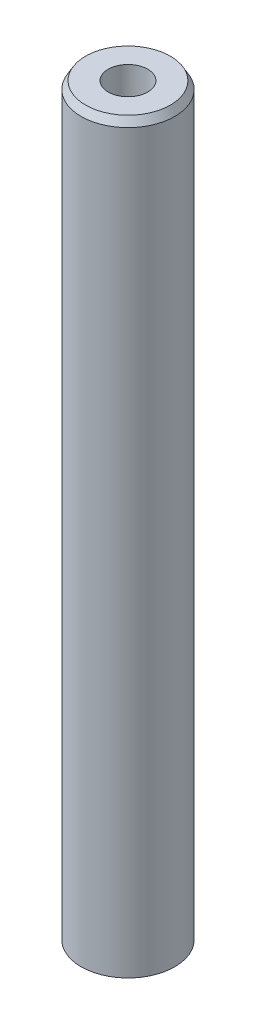
ISO-10303-21;
HEADER;
FILE_DESCRIPTION(('STEP AP214'),'2;1');
FILE_NAME('part.step','',(''),(''),'','','');
FILE_SCHEMA(('AUTOMOTIVE_DESIGN { 1 0 10303 214 1 1 1 1 }'));
ENDSEC;
DATA;
#1=APPLICATION_CONTEXT('core data for automotive mechanical design processes');
#2=APPLICATION_PROTOCOL_DEFINITION('international standard','automotive_design',2000,#1);
#3=PRODUCT_CONTEXT('',#1,'mechanical');
#4=PRODUCT('Part','Part','',(#3));
#5=PRODUCT_RELATED_PRODUCT_CATEGORY('part','',(#4));
#6=PRODUCT_DEFINITION_FORMATION('','',#4);
#7=PRODUCT_DEFINITION_CONTEXT('part definition',#1,'design');
#8=PRODUCT_DEFINITION('design','',#6,#7);
#9=PRODUCT_DEFINITION_SHAPE('','',#8);
#10=(LENGTH_UNIT() NAMED_UNIT(*) SI_UNIT(.MILLI.,.METRE.));
#11=(NAMED_UNIT(*) PLANE_ANGLE_UNIT() SI_UNIT($,.RADIAN.));
#12=(NAMED_UNIT(*) SI_UNIT($,.STERADIAN.) SOLID_ANGLE_UNIT());
#13=UNCERTAINTY_MEASURE_WITH_UNIT(LENGTH_MEASURE(1.E-05),#10,'distance_accuracy_value','');
#14=(GEOMETRIC_REPRESENTATION_CONTEXT(3) GLOBAL_UNCERTAINTY_ASSIGNED_CONTEXT((#13)) GLOBAL_UNIT_ASSIGNED_CONTEXT((#10,
#11,#12)) REPRESENTATION_CONTEXT('',''));
#15=CARTESIAN_POINT('',(0.,0.,0.));
#16=DIRECTION('',(0.,0.,1.));
#17=DIRECTION('',(1.,0.,0.));
#18=AXIS2_PLACEMENT_3D('',#15,#16,#17);
#19=CARTESIAN_POINT('',(0.,319.761376586418,0.));
#20=DIRECTION('',(0.,-1.,0.));
#21=DIRECTION('',(0.,0.,-1.));
#22=AXIS2_PLACEMENT_3D('',#19,#20,#21);
#23=CYLINDRICAL_SURFACE('',#22,20.);
#24=CARTESIAN_POINT('',(0.,316.492916905583,0.));
#25=DIRECTION('',(0.,1.,0.));
#26=DIRECTION('',(0.,0.,1.));
#27=AXIS2_PLACEMENT_3D('',#24,#25,#26);
#28=CIRCLE('',#27,20.);
#29=CARTESIAN_POINT('',(0.,316.492916905583,20.));
#30=VERTEX_POINT('',#29);
#31=EDGE_CURVE('E50',#30,#30,#28,.F.);
#32=ORIENTED_EDGE('',*,*,#31,.T.);
#33=EDGE_LOOP('',(#32));
#34=FACE_BOUND('',#33,.T.);
#35=CARTESIAN_POINT('',(0.,1.88704607656559,0.));
#36=DIRECTION('',(0.,1.,0.));
#37=DIRECTION('',(0.,0.,1.));
#38=AXIS2_PLACEMENT_3D('',#35,#36,#37);
#39=CIRCLE('',#38,20.);
#40=CARTESIAN_POINT('',(0.,1.88704607656559,20.));
#41=VERTEX_POINT('',#40);
#42=EDGE_CURVE('E51',#41,#41,#39,.T.);
#43=ORIENTED_EDGE('',*,*,#42,.T.);
#44=EDGE_LOOP('',(#43));
#45=FACE_BOUND('',#44,.T.);
#46=ADVANCED_FACE('F39',(#34,#45),#23,.T.);
#47=CARTESIAN_POINT('',(0.,319.761376586418,0.));
#48=DIRECTION('',(0.,1.,0.));
#49=DIRECTION('',(0.,0.,1.));
#50=AXIS2_PLACEMENT_3D('',#47,#48,#49);
#51=PLANE('',#50);
#52=CARTESIAN_POINT('',(0.,319.761376586418,0.));
#53=DIRECTION('',(0.,1.,0.));
#54=DIRECTION('',(0.,0.,1.));
#55=AXIS2_PLACEMENT_3D('',#52,#53,#54);
#56=CIRCLE('',#55,18.1129539234345);
#57=CARTESIAN_POINT('',(0.,319.761376586418,18.1129539234345));
#58=VERTEX_POINT('',#57);
#59=EDGE_CURVE('E54',#58,#58,#56,.T.);
#60=ORIENTED_EDGE('',*,*,#59,.T.);
#61=EDGE_LOOP('',(#60));
#62=FACE_BOUND('',#61,.T.);
#63=CARTESIAN_POINT('',(0.,319.761376586418,0.));
#64=DIRECTION('',(0.,1.,0.));
#65=DIRECTION('',(0.,0.,1.));
#66=AXIS2_PLACEMENT_3D('',#63,#64,#65);
#67=CIRCLE('',#66,8.45053792491208);
#68=CARTESIAN_POINT('',(0.,319.761376586418,8.45053792491208));
#69=VERTEX_POINT('',#68);
#70=EDGE_CURVE('E58',#69,#69,#67,.T.);
#71=ORIENTED_EDGE('',*,*,#70,.F.);
#72=EDGE_LOOP('',(#71));
#73=FACE_BOUND('',#72,.T.);
#74=ADVANCED_FACE('F69',(#62,#73),#51,.T.);
#75=CARTESIAN_POINT('',(0.,0.,0.));
#76=DIRECTION('',(0.,1.,0.));
#77=DIRECTION('',(0.,0.,1.));
#78=AXIS2_PLACEMENT_3D('',#75,#76,#77);
#79=PLANE('',#78);
#80=CARTESIAN_POINT('',(0.,0.,0.));
#81=DIRECTION('',(0.,1.,0.));
#82=DIRECTION('',(0.,0.,1.));
#83=AXIS2_PLACEMENT_3D('',#80,#81,#82);
#84=CIRCLE('',#83,16.7315403191649);
#85=CARTESIAN_POINT('',(0.,0.,16.7315403191649));
#86=VERTEX_POINT('',#85);
#87=EDGE_CURVE('E10',#86,#86,#84,.F.);
#88=ORIENTED_EDGE('',*,*,#87,.T.);
#89=EDGE_LOOP('',(#88));
#90=FACE_BOUND('',#89,.T.);
#91=CARTESIAN_POINT('',(0.,0.,0.));
#92=DIRECTION('',(0.,1.,0.));
#93=DIRECTION('',(0.,0.,1.));
#94=AXIS2_PLACEMENT_3D('',#91,#92,#93);
#95=CIRCLE('',#94,8.45053792491208);
#96=CARTESIAN_POINT('',(0.,0.,8.45053792491208));
#97=VERTEX_POINT('',#96);
#98=EDGE_CURVE('E63',#97,#97,#95,.T.);
#99=ORIENTED_EDGE('',*,*,#98,.T.);
#100=EDGE_LOOP('',(#99));
#101=FACE_BOUND('',#100,.T.);
#102=ADVANCED_FACE('F75',(#90,#101),#79,.F.);
#103=CARTESIAN_POINT('',(0.,319.761376586418,0.));
#104=DIRECTION('',(0.,-1.,0.));
#105=DIRECTION('',(0.,0.,-1.));
#106=AXIS2_PLACEMENT_3D('',#103,#104,#105);
#107=CYLINDRICAL_SURFACE('',#106,8.45053792491208);
#108=ORIENTED_EDGE('',*,*,#70,.T.);
#109=EDGE_LOOP('',(#108));
#110=FACE_BOUND('',#109,.T.);
#111=ORIENTED_EDGE('',*,*,#98,.F.);
#112=EDGE_LOOP('',(#111));
#113=FACE_BOUND('',#112,.T.);
#114=ADVANCED_FACE('F70',(#110,#113),#107,.F.);
#115=CARTESIAN_POINT('',(0.,319.761376586418,0.));
#116=DIRECTION('',(0.,-1.,0.));
#117=DIRECTION('',(0.,0.,-1.));
#118=AXIS2_PLACEMENT_3D('',#115,#116,#117);
#119=CONICAL_SURFACE('',#118,18.1129539234345,0.523598775598282);
#120=ORIENTED_EDGE('',*,*,#31,.F.);
#121=EDGE_LOOP('',(#120));
#122=FACE_BOUND('',#121,.T.);
#123=ORIENTED_EDGE('',*,*,#59,.F.);
#124=EDGE_LOOP('',(#123));
#125=FACE_BOUND('',#124,.T.);
#126=ADVANCED_FACE('F81',(#122,#125),#119,.T.);
#127=CARTESIAN_POINT('',(0.,1.88704607656559,0.));
#128=DIRECTION('',(0.,1.,0.));
#129=DIRECTION('',(0.,0.,1.));
#130=AXIS2_PLACEMENT_3D('',#127,#128,#129);
#131=CONICAL_SURFACE('',#130,20.,1.0471975511966);
#132=ORIENTED_EDGE('',*,*,#87,.F.);
#133=EDGE_LOOP('',(#132));
#134=FACE_BOUND('',#133,.T.);
#135=ORIENTED_EDGE('',*,*,#42,.F.);
#136=EDGE_LOOP('',(#135));
#137=FACE_BOUND('',#136,.T.);
#138=ADVANCED_FACE('F45',(#134,#137),#131,.T.);
#139=CLOSED_SHELL('',(#46,#74,#102,#114,#126,#138));
#140=MANIFOLD_SOLID_BREP('B2',#139);
#141=ADVANCED_BREP_SHAPE_REPRESENTATION('',(#18,#140),#14);
#142=SHAPE_DEFINITION_REPRESENTATION(#9,#141);
ENDSEC;
END-ISO-10303-21;
